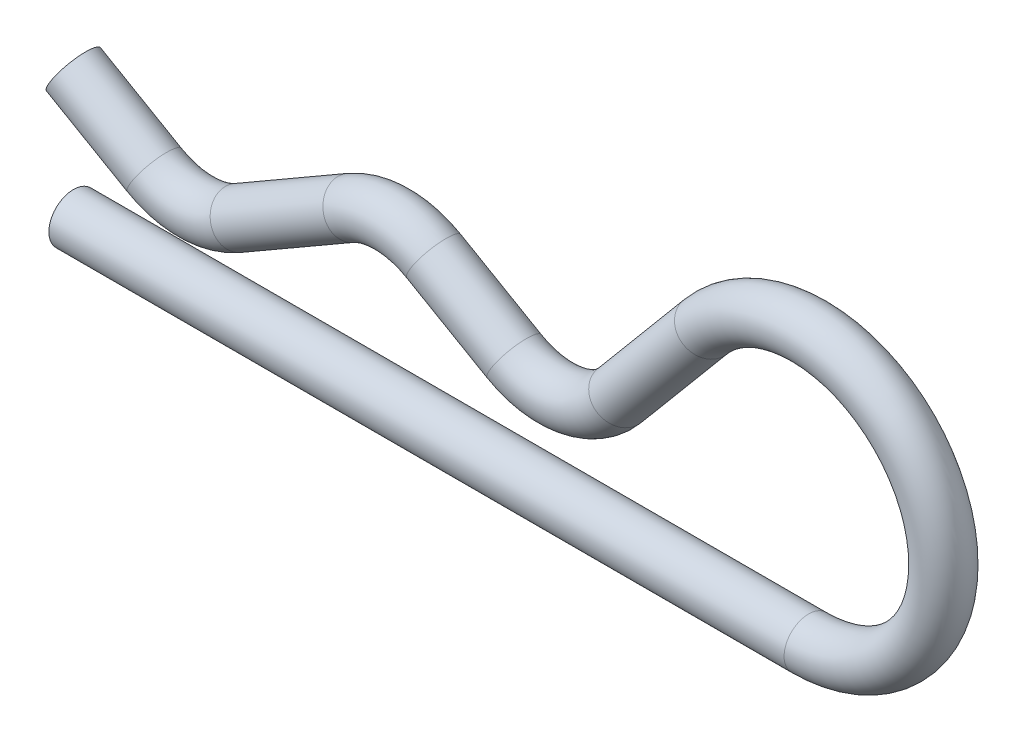
ISO-10303-21;
HEADER;
FILE_DESCRIPTION(('STEP AP214'),'2;1');
FILE_NAME('part.step','',(''),(''),'','','');
FILE_SCHEMA(('AUTOMOTIVE_DESIGN { 1 0 10303 214 1 1 1 1 }'));
ENDSEC;
DATA;
#1=APPLICATION_CONTEXT('core data for automotive mechanical design processes');
#2=APPLICATION_PROTOCOL_DEFINITION('international standard','automotive_design',2000,#1);
#3=PRODUCT_CONTEXT('',#1,'mechanical');
#4=PRODUCT('Part','Part','',(#3));
#5=PRODUCT_RELATED_PRODUCT_CATEGORY('part','',(#4));
#6=PRODUCT_DEFINITION_FORMATION('','',#4);
#7=PRODUCT_DEFINITION_CONTEXT('part definition',#1,'design');
#8=PRODUCT_DEFINITION('design','',#6,#7);
#9=PRODUCT_DEFINITION_SHAPE('','',#8);
#10=(LENGTH_UNIT() NAMED_UNIT(*) SI_UNIT(.MILLI.,.METRE.));
#11=(NAMED_UNIT(*) PLANE_ANGLE_UNIT() SI_UNIT($,.RADIAN.));
#12=(NAMED_UNIT(*) SI_UNIT($,.STERADIAN.) SOLID_ANGLE_UNIT());
#13=UNCERTAINTY_MEASURE_WITH_UNIT(LENGTH_MEASURE(1.E-05),#10,'distance_accuracy_value','');
#14=(GEOMETRIC_REPRESENTATION_CONTEXT(3) GLOBAL_UNCERTAINTY_ASSIGNED_CONTEXT((#13)) GLOBAL_UNIT_ASSIGNED_CONTEXT((#10,
#11,#12)) REPRESENTATION_CONTEXT('',''));
#15=CARTESIAN_POINT('',(0.,0.,0.));
#16=DIRECTION('',(0.,0.,1.));
#17=DIRECTION('',(1.,0.,0.));
#18=AXIS2_PLACEMENT_3D('',#15,#16,#17);
#19=CARTESIAN_POINT('',(1.64999999999998,1.67209438086384,0.));
#20=DIRECTION('',(-0.866025403784442,0.499999999999994,0.));
#21=DIRECTION('',(-0.499999999999994,-0.866025403784442,0.));
#22=AXIS2_PLACEMENT_3D('',#19,#20,#21);
#23=CYLINDRICAL_SURFACE('',#22,0.5);
#24=CARTESIAN_POINT('',(1.64999999999998,1.67209438086384,0.));
#25=DIRECTION('',(-0.866025403784449,0.499999999999981,0.));
#26=DIRECTION('',(0.,0.,-1.));
#27=AXIS2_PLACEMENT_3D('',#24,#25,#26);
#28=CIRCLE('',#27,0.5);
#29=CARTESIAN_POINT('',(1.39999999999997,1.23908167897162,0.));
#30=VERTEX_POINT('',#29);
#31=EDGE_CURVE('E37',#30,#30,#28,.T.);
#32=ORIENTED_EDGE('',*,*,#31,.T.);
#33=EDGE_LOOP('',(#32));
#34=FACE_BOUND('',#33,.T.);
#35=CARTESIAN_POINT('',(0.,2.62472232502671,0.));
#36=DIRECTION('',(-0.866025403784449,0.499999999999981,0.));
#37=DIRECTION('',(0.,0.,-1.));
#38=AXIS2_PLACEMENT_3D('',#35,#36,#37);
#39=CIRCLE('',#38,0.5);
#40=CARTESIAN_POINT('',(0.,2.62472232502671,-0.5));
#41=VERTEX_POINT('',#40);
#42=EDGE_CURVE('E10',#41,#41,#39,.T.);
#43=ORIENTED_EDGE('',*,*,#42,.F.);
#44=EDGE_LOOP('',(#43));
#45=FACE_BOUND('',#44,.T.);
#46=ADVANCED_FACE('F31',(#34,#45),#23,.T.);
#47=CARTESIAN_POINT('',(2.5,3.14433756729737,0.));
#48=DIRECTION('',(0.,0.,-1.));
#49=DIRECTION('',(-1.,0.,0.));
#50=AXIS2_PLACEMENT_3D('',#47,#48,#49);
#51=TOROIDAL_SURFACE('',#50,1.7,0.5);
#52=CARTESIAN_POINT('',(3.34999999999998,1.67209438086381,0.));
#53=DIRECTION('',(-0.866025403784427,-0.50000000000002,0.));
#54=DIRECTION('',(0.,0.,-1.));
#55=AXIS2_PLACEMENT_3D('',#52,#53,#54);
#56=CIRCLE('',#55,0.5);
#57=CARTESIAN_POINT('',(3.59999999999998,1.23908167897159,0.));
#58=VERTEX_POINT('',#57);
#59=EDGE_CURVE('E41',#58,#58,#56,.T.);
#60=CARTESIAN_POINT('',(2.5,3.14433756729737,0.));
#61=DIRECTION('',(0.,0.,-1.));
#62=DIRECTION('',(-1.,0.,0.));
#63=AXIS2_PLACEMENT_3D('',#60,#61,#62);
#64=CIRCLE('',#63,2.2);
#65=EDGE_CURVE('',#58,#30,#64,.T.);
#66=ORIENTED_EDGE('',*,*,#59,.T.);
#67=ORIENTED_EDGE('',*,*,#31,.F.);
#68=ORIENTED_EDGE('',*,*,#65,.T.);
#69=ORIENTED_EDGE('',*,*,#65,.F.);
#70=EDGE_LOOP('',(#66,#68,#67,#69));
#71=FACE_BOUND('',#70,.T.);
#72=ADVANCED_FACE('F87',(#71),#51,.T.);
#73=CARTESIAN_POINT('',(5.64999999999996,2.99999999999997,0.));
#74=DIRECTION('',(-0.866025403784434,-0.500000000000008,0.));
#75=DIRECTION('',(0.500000000000008,-0.866025403784434,0.));
#76=AXIS2_PLACEMENT_3D('',#73,#74,#75);
#77=CYLINDRICAL_SURFACE('',#76,0.5);
#78=CARTESIAN_POINT('',(5.64999999999996,2.99999999999997,0.));
#79=DIRECTION('',(-0.866025403784427,-0.50000000000002,0.));
#80=DIRECTION('',(0.,0.,-1.));
#81=AXIS2_PLACEMENT_3D('',#78,#79,#80);
#82=CIRCLE('',#81,0.5);
#83=CARTESIAN_POINT('',(5.39999999999994,3.43301270189218,0.));
#84=VERTEX_POINT('',#83);
#85=EDGE_CURVE('E45',#84,#84,#82,.T.);
#86=ORIENTED_EDGE('',*,*,#85,.T.);
#87=EDGE_LOOP('',(#86));
#88=FACE_BOUND('',#87,.T.);
#89=ORIENTED_EDGE('',*,*,#59,.F.);
#90=EDGE_LOOP('',(#89));
#91=FACE_BOUND('',#90,.T.);
#92=ADVANCED_FACE('F91',(#88,#91),#77,.T.);
#93=CARTESIAN_POINT('',(6.5,1.52775681356645,0.));
#94=DIRECTION('',(0.,0.,1.));
#95=DIRECTION('',(1.,0.,0.));
#96=AXIS2_PLACEMENT_3D('',#93,#94,#95);
#97=TOROIDAL_SURFACE('',#96,1.7,0.5);
#98=CARTESIAN_POINT('',(7.34999999999996,3.00000000000002,0.));
#99=DIRECTION('',(-0.866025403784449,0.499999999999981,0.));
#100=DIRECTION('',(0.,0.,-1.));
#101=AXIS2_PLACEMENT_3D('',#98,#99,#100);
#102=CIRCLE('',#101,0.5);
#103=CARTESIAN_POINT('',(7.59999999999995,3.43301270189224,0.));
#104=VERTEX_POINT('',#103);
#105=EDGE_CURVE('E50',#104,#104,#102,.T.);
#106=CARTESIAN_POINT('',(6.5,1.52775681356645,0.));
#107=DIRECTION('',(0.,0.,1.));
#108=DIRECTION('',(1.,0.,0.));
#109=AXIS2_PLACEMENT_3D('',#106,#107,#108);
#110=CIRCLE('',#109,2.2);
#111=EDGE_CURVE('',#104,#84,#110,.T.);
#112=ORIENTED_EDGE('',*,*,#105,.T.);
#113=ORIENTED_EDGE('',*,*,#85,.F.);
#114=ORIENTED_EDGE('',*,*,#111,.T.);
#115=ORIENTED_EDGE('',*,*,#111,.F.);
#116=EDGE_LOOP('',(#112,#114,#113,#115));
#117=FACE_BOUND('',#116,.T.);
#118=ADVANCED_FACE('F97',(#117),#97,.T.);
#119=CARTESIAN_POINT('',(8.99105491444573,2.0525365033898,0.));
#120=DIRECTION('',(-0.866025403784442,0.499999999999995,0.));
#121=DIRECTION('',(-0.499999999999995,-0.866025403784442,0.));
#122=AXIS2_PLACEMENT_3D('',#119,#120,#121);
#123=CYLINDRICAL_SURFACE('',#122,0.5);
#124=CARTESIAN_POINT('',(8.99105491444573,2.0525365033898,0.));
#125=DIRECTION('',(-0.866025403784449,0.499999999999981,0.));
#126=DIRECTION('',(0.,0.,-1.));
#127=AXIS2_PLACEMENT_3D('',#124,#125,#126);
#128=CIRCLE('',#127,0.5);
#129=CARTESIAN_POINT('',(8.74105491444573,1.61952380149759,0.));
#130=VERTEX_POINT('',#129);
#131=EDGE_CURVE('E53',#130,#130,#128,.T.);
#132=ORIENTED_EDGE('',*,*,#131,.T.);
#133=EDGE_LOOP('',(#132));
#134=FACE_BOUND('',#133,.T.);
#135=ORIENTED_EDGE('',*,*,#105,.F.);
#136=EDGE_LOOP('',(#135));
#137=FACE_BOUND('',#136,.T.);
#138=ADVANCED_FACE('F104',(#134,#137),#123,.T.);
#139=CARTESIAN_POINT('',(9.84105491444575,3.52477968982334,0.));
#140=DIRECTION('',(0.,0.,-1.));
#141=DIRECTION('',(-1.,0.,0.));
#142=AXIS2_PLACEMENT_3D('',#139,#140,#141);
#143=TOROIDAL_SURFACE('',#142,1.7,0.5);
#144=CARTESIAN_POINT('',(11.143330467748,2.43204075335619,0.));
#145=DIRECTION('',(-0.642787609686533,-0.766044443118983,0.));
#146=DIRECTION('',(0.,0.,-1.));
#147=AXIS2_PLACEMENT_3D('',#144,#145,#146);
#148=CIRCLE('',#147,0.5);
#149=CARTESIAN_POINT('',(11.5263526893075,2.11064694851291,0.));
#150=VERTEX_POINT('',#149);
#151=EDGE_CURVE('E56',#150,#150,#148,.T.);
#152=CARTESIAN_POINT('',(9.84105491444575,3.52477968982334,0.));
#153=DIRECTION('',(0.,0.,-1.));
#154=DIRECTION('',(-1.,0.,0.));
#155=AXIS2_PLACEMENT_3D('',#152,#153,#154);
#156=CIRCLE('',#155,2.2);
#157=EDGE_CURVE('',#150,#130,#156,.T.);
#158=ORIENTED_EDGE('',*,*,#151,.T.);
#159=ORIENTED_EDGE('',*,*,#131,.F.);
#160=ORIENTED_EDGE('',*,*,#157,.T.);
#161=ORIENTED_EDGE('',*,*,#157,.F.);
#162=EDGE_LOOP('',(#158,#160,#159,#161));
#163=FACE_BOUND('',#162,.T.);
#164=ADVANCED_FACE('F108',(#163),#143,.T.);
#165=CARTESIAN_POINT('',(12.8933777814228,4.51766592663797,0.));
#166=DIRECTION('',(-0.642787609686543,-0.766044443118975,0.));
#167=DIRECTION('',(0.766044443118975,-0.642787609686543,0.));
#168=AXIS2_PLACEMENT_3D('',#165,#166,#167);
#169=CYLINDRICAL_SURFACE('',#168,0.5);
#170=CARTESIAN_POINT('',(12.8933777814228,4.51766592663797,0.));
#171=DIRECTION('',(-0.642787609686533,-0.766044443118983,0.));
#172=DIRECTION('',(0.,0.,-1.));
#173=AXIS2_PLACEMENT_3D('',#170,#171,#172);
#174=CIRCLE('',#173,0.5);
#175=CARTESIAN_POINT('',(12.5103555598633,4.83905973148123,0.));
#176=VERTEX_POINT('',#175);
#177=EDGE_CURVE('E59',#176,#176,#174,.T.);
#178=ORIENTED_EDGE('',*,*,#177,.T.);
#179=EDGE_LOOP('',(#178));
#180=FACE_BOUND('',#179,.T.);
#181=ORIENTED_EDGE('',*,*,#151,.F.);
#182=EDGE_LOOP('',(#181));
#183=FACE_BOUND('',#182,.T.);
#184=ADVANCED_FACE('F112',(#180,#183),#169,.T.);
#185=CARTESIAN_POINT('',(15.,2.75,0.));
#186=DIRECTION('',(0.,0.,1.));
#187=DIRECTION('',(1.,0.,0.));
#188=AXIS2_PLACEMENT_3D('',#185,#186,#187);
#189=TOROIDAL_SURFACE('',#188,2.75,0.5);
#190=CARTESIAN_POINT('',(15.,0.,0.));
#191=DIRECTION('',(1.,0.,0.));
#192=DIRECTION('',(0.,0.,-1.));
#193=AXIS2_PLACEMENT_3D('',#190,#191,#192);
#194=CIRCLE('',#193,0.5);
#195=CARTESIAN_POINT('',(15.,-0.5,0.));
#196=VERTEX_POINT('',#195);
#197=EDGE_CURVE('E62',#196,#196,#194,.T.);
#198=CARTESIAN_POINT('',(15.,2.75,0.));
#199=DIRECTION('',(0.,0.,1.));
#200=DIRECTION('',(1.,0.,0.));
#201=AXIS2_PLACEMENT_3D('',#198,#199,#200);
#202=CIRCLE('',#201,3.25);
#203=EDGE_CURVE('',#196,#176,#202,.T.);
#204=ORIENTED_EDGE('',*,*,#197,.T.);
#205=ORIENTED_EDGE('',*,*,#177,.F.);
#206=ORIENTED_EDGE('',*,*,#203,.T.);
#207=ORIENTED_EDGE('',*,*,#203,.F.);
#208=EDGE_LOOP('',(#204,#206,#205,#207));
#209=FACE_BOUND('',#208,.T.);
#210=ADVANCED_FACE('F69',(#209),#189,.T.);
#211=CARTESIAN_POINT('',(15.,0.,0.));
#212=DIRECTION('',(-1.,0.,0.));
#213=DIRECTION('',(0.,0.,1.));
#214=AXIS2_PLACEMENT_3D('',#211,#212,#213);
#215=CYLINDRICAL_SURFACE('',#214,0.5);
#216=ORIENTED_EDGE('',*,*,#197,.F.);
#217=EDGE_LOOP('',(#216));
#218=FACE_BOUND('',#217,.T.);
#219=CARTESIAN_POINT('',(0.,0.,0.));
#220=DIRECTION('',(1.,0.,0.));
#221=DIRECTION('',(0.,0.,-1.));
#222=AXIS2_PLACEMENT_3D('',#219,#220,#221);
#223=CIRCLE('',#222,0.5);
#224=CARTESIAN_POINT('',(0.,0.,-0.5));
#225=VERTEX_POINT('',#224);
#226=EDGE_CURVE('E63',#225,#225,#223,.T.);
#227=ORIENTED_EDGE('',*,*,#226,.T.);
#228=EDGE_LOOP('',(#227));
#229=FACE_BOUND('',#228,.T.);
#230=ADVANCED_FACE('F72',(#218,#229),#215,.T.);
#231=CARTESIAN_POINT('',(0.,2.62472232502671,0.));
#232=DIRECTION('',(-0.866025403784449,0.499999999999981,0.));
#233=DIRECTION('',(0.,0.,-1.));
#234=AXIS2_PLACEMENT_3D('',#231,#232,#233);
#235=PLANE('',#234);
#236=ORIENTED_EDGE('',*,*,#42,.T.);
#237=EDGE_LOOP('',(#236));
#238=FACE_BOUND('',#237,.T.);
#239=ADVANCED_FACE('F75',(#238),#235,.T.);
#240=CARTESIAN_POINT('',(0.,0.,0.));
#241=DIRECTION('',(1.,0.,0.));
#242=DIRECTION('',(0.,0.,-1.));
#243=AXIS2_PLACEMENT_3D('',#240,#241,#242);
#244=PLANE('',#243);
#245=ORIENTED_EDGE('',*,*,#226,.F.);
#246=EDGE_LOOP('',(#245));
#247=FACE_BOUND('',#246,.T.);
#248=ADVANCED_FACE('F79',(#247),#244,.F.);
#249=CLOSED_SHELL('',(#46,#72,#92,#118,#138,#164,#184,#210,#230,#239,#248));
#250=MANIFOLD_SOLID_BREP('B2',#249);
#251=ADVANCED_BREP_SHAPE_REPRESENTATION('',(#18,#250),#14);
#252=SHAPE_DEFINITION_REPRESENTATION(#9,#251);
ENDSEC;
END-ISO-10303-21;
